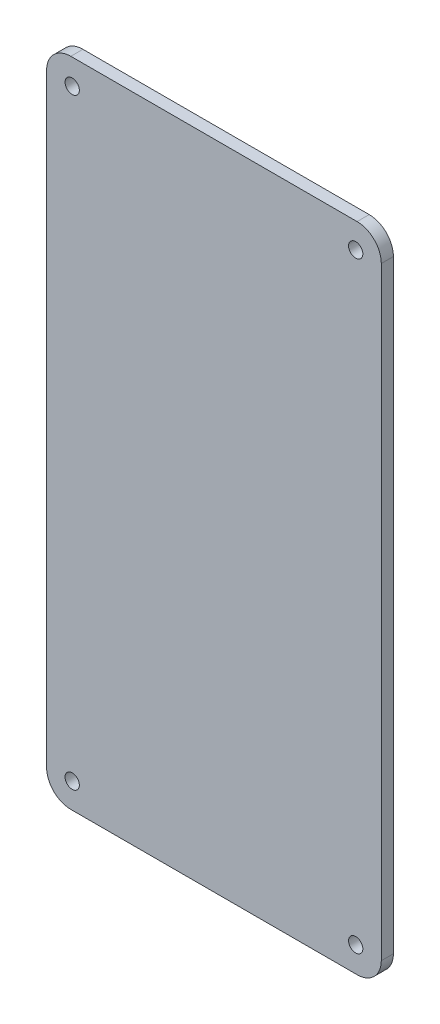
ISO-10303-21;
HEADER;
FILE_DESCRIPTION(('STEP AP214'),'2;1');
FILE_NAME('part.step','',(''),(''),'','','');
FILE_SCHEMA(('AUTOMOTIVE_DESIGN { 1 0 10303 214 1 1 1 1 }'));
ENDSEC;
DATA;
#1=APPLICATION_CONTEXT('core data for automotive mechanical design processes');
#2=APPLICATION_PROTOCOL_DEFINITION('international standard','automotive_design',2000,#1);
#3=PRODUCT_CONTEXT('',#1,'mechanical');
#4=PRODUCT('Part','Part','',(#3));
#5=PRODUCT_RELATED_PRODUCT_CATEGORY('part','',(#4));
#6=PRODUCT_DEFINITION_FORMATION('','',#4);
#7=PRODUCT_DEFINITION_CONTEXT('part definition',#1,'design');
#8=PRODUCT_DEFINITION('design','',#6,#7);
#9=PRODUCT_DEFINITION_SHAPE('','',#8);
#10=(LENGTH_UNIT() NAMED_UNIT(*) SI_UNIT(.MILLI.,.METRE.));
#11=(NAMED_UNIT(*) PLANE_ANGLE_UNIT() SI_UNIT($,.RADIAN.));
#12=(NAMED_UNIT(*) SI_UNIT($,.STERADIAN.) SOLID_ANGLE_UNIT());
#13=UNCERTAINTY_MEASURE_WITH_UNIT(LENGTH_MEASURE(1.E-05),#10,'distance_accuracy_value','');
#14=(GEOMETRIC_REPRESENTATION_CONTEXT(3) GLOBAL_UNCERTAINTY_ASSIGNED_CONTEXT((#13)) GLOBAL_UNIT_ASSIGNED_CONTEXT((#10,
#11,#12)) REPRESENTATION_CONTEXT('',''));
#15=CARTESIAN_POINT('',(0.,0.,0.));
#16=DIRECTION('',(0.,0.,1.));
#17=DIRECTION('',(1.,0.,0.));
#18=AXIS2_PLACEMENT_3D('',#15,#16,#17);
#19=CARTESIAN_POINT('',(-30.04505,-63.36755,2.54));
#20=DIRECTION('',(0.,0.,-1.));
#21=DIRECTION('',(-1.,0.,0.));
#22=AXIS2_PLACEMENT_3D('',#19,#20,#21);
#23=CYLINDRICAL_SURFACE('',#22,5.08);
#24=CARTESIAN_POINT('',(-30.04505,-63.36755,0.));
#25=DIRECTION('',(0.,0.,1.));
#26=DIRECTION('',(-1.,0.,0.));
#27=AXIS2_PLACEMENT_3D('',#24,#25,#26);
#28=CIRCLE('',#27,5.08);
#29=CARTESIAN_POINT('',(-35.12505,-63.36755,0.));
#30=VERTEX_POINT('',#29);
#31=CARTESIAN_POINT('',(-30.04505,-68.44755,0.));
#32=VERTEX_POINT('',#31);
#33=EDGE_CURVE('E146',#30,#32,#28,.T.);
#34=ORIENTED_EDGE('',*,*,#33,.T.);
#35=DIRECTION('',(0.,0.,-1.));
#36=VECTOR('',#35,1.);
#37=CARTESIAN_POINT('',(-30.04505,-68.44755,2.54));
#38=LINE('',#37,#36);
#39=CARTESIAN_POINT('',(-30.04505,-68.44755,2.54));
#40=VERTEX_POINT('',#39);
#41=EDGE_CURVE('E11',#40,#32,#38,.T.);
#42=ORIENTED_EDGE('',*,*,#41,.F.);
#43=CARTESIAN_POINT('',(-30.04505,-63.36755,2.54));
#44=DIRECTION('',(0.,0.,1.));
#45=DIRECTION('',(-1.,0.,0.));
#46=AXIS2_PLACEMENT_3D('',#43,#44,#45);
#47=CIRCLE('',#46,5.08);
#48=CARTESIAN_POINT('',(-35.12505,-63.36755,2.54));
#49=VERTEX_POINT('',#48);
#50=EDGE_CURVE('E169',#49,#40,#47,.T.);
#51=ORIENTED_EDGE('',*,*,#50,.F.);
#52=DIRECTION('',(0.,0.,-1.));
#53=VECTOR('',#52,1.);
#54=CARTESIAN_POINT('',(-35.12505,-63.36755,2.54));
#55=LINE('',#54,#53);
#56=EDGE_CURVE('E142',#49,#30,#55,.T.);
#57=ORIENTED_EDGE('',*,*,#56,.T.);
#58=EDGE_LOOP('',(#34,#42,#51,#57));
#59=FACE_BOUND('',#58,.T.);
#60=ADVANCED_FACE('F45',(#59),#23,.T.);
#61=CARTESIAN_POINT('',(-30.04505,-68.44755,2.54));
#62=DIRECTION('',(0.,1.,0.));
#63=DIRECTION('',(0.,0.,1.));
#64=AXIS2_PLACEMENT_3D('',#61,#62,#63);
#65=PLANE('',#64);
#66=DIRECTION('',(1.,0.,0.));
#67=VECTOR('',#66,1.);
#68=CARTESIAN_POINT('',(-30.04505,-68.44755,0.));
#69=LINE('',#68,#67);
#70=CARTESIAN_POINT('',(30.04505,-68.44755,0.));
#71=VERTEX_POINT('',#70);
#72=EDGE_CURVE('E150',#32,#71,#69,.T.);
#73=ORIENTED_EDGE('',*,*,#72,.T.);
#74=DIRECTION('',(0.,0.,-1.));
#75=VECTOR('',#74,1.);
#76=CARTESIAN_POINT('',(30.04505,-68.44755,2.54));
#77=LINE('',#76,#75);
#78=CARTESIAN_POINT('',(30.04505,-68.44755,2.54));
#79=VERTEX_POINT('',#78);
#80=EDGE_CURVE('E54',#79,#71,#77,.T.);
#81=ORIENTED_EDGE('',*,*,#80,.F.);
#82=DIRECTION('',(1.,0.,0.));
#83=VECTOR('',#82,1.);
#84=CARTESIAN_POINT('',(-30.04505,-68.44755,2.54));
#85=LINE('',#84,#83);
#86=EDGE_CURVE('E105',#40,#79,#85,.T.);
#87=ORIENTED_EDGE('',*,*,#86,.F.);
#88=ORIENTED_EDGE('',*,*,#41,.T.);
#89=EDGE_LOOP('',(#73,#81,#87,#88));
#90=FACE_BOUND('',#89,.T.);
#91=ADVANCED_FACE('F270',(#90),#65,.F.);
#92=CARTESIAN_POINT('',(30.04505,-63.36755,2.54));
#93=DIRECTION('',(0.,0.,-1.));
#94=DIRECTION('',(-1.,0.,0.));
#95=AXIS2_PLACEMENT_3D('',#92,#93,#94);
#96=CYLINDRICAL_SURFACE('',#95,5.08);
#97=CARTESIAN_POINT('',(30.04505,-63.36755,0.));
#98=DIRECTION('',(0.,0.,1.));
#99=DIRECTION('',(1.,0.,0.));
#100=AXIS2_PLACEMENT_3D('',#97,#98,#99);
#101=CIRCLE('',#100,5.08);
#102=CARTESIAN_POINT('',(35.12505,-63.36755,0.));
#103=VERTEX_POINT('',#102);
#104=EDGE_CURVE('E154',#71,#103,#101,.T.);
#105=ORIENTED_EDGE('',*,*,#104,.T.);
#106=DIRECTION('',(0.,0.,-1.));
#107=VECTOR('',#106,1.);
#108=CARTESIAN_POINT('',(35.12505,-63.36755,2.54));
#109=LINE('',#108,#107);
#110=CARTESIAN_POINT('',(35.12505,-63.36755,2.54));
#111=VERTEX_POINT('',#110);
#112=EDGE_CURVE('E180',#111,#103,#109,.T.);
#113=ORIENTED_EDGE('',*,*,#112,.F.);
#114=CARTESIAN_POINT('',(30.04505,-63.36755,2.54));
#115=DIRECTION('',(0.,0.,1.));
#116=DIRECTION('',(1.,0.,0.));
#117=AXIS2_PLACEMENT_3D('',#114,#115,#116);
#118=CIRCLE('',#117,5.08);
#119=EDGE_CURVE('E190',#79,#111,#118,.T.);
#120=ORIENTED_EDGE('',*,*,#119,.F.);
#121=ORIENTED_EDGE('',*,*,#80,.T.);
#122=EDGE_LOOP('',(#105,#113,#120,#121));
#123=FACE_BOUND('',#122,.T.);
#124=ADVANCED_FACE('F188',(#123),#96,.T.);
#125=CARTESIAN_POINT('',(35.12505,-63.36755,2.54));
#126=DIRECTION('',(-1.,0.,0.));
#127=DIRECTION('',(0.,0.,1.));
#128=AXIS2_PLACEMENT_3D('',#125,#126,#127);
#129=PLANE('',#128);
#130=DIRECTION('',(0.,1.,0.));
#131=VECTOR('',#130,1.);
#132=CARTESIAN_POINT('',(35.12505,-63.36755,0.));
#133=LINE('',#132,#131);
#134=CARTESIAN_POINT('',(35.12505,63.36755,0.));
#135=VERTEX_POINT('',#134);
#136=EDGE_CURVE('E157',#103,#135,#133,.T.);
#137=ORIENTED_EDGE('',*,*,#136,.T.);
#138=DIRECTION('',(0.,0.,-1.));
#139=VECTOR('',#138,1.);
#140=CARTESIAN_POINT('',(35.12505,63.36755,2.54));
#141=LINE('',#140,#139);
#142=CARTESIAN_POINT('',(35.12505,63.36755,2.54));
#143=VERTEX_POINT('',#142);
#144=EDGE_CURVE('E176',#143,#135,#141,.T.);
#145=ORIENTED_EDGE('',*,*,#144,.F.);
#146=DIRECTION('',(0.,1.,0.));
#147=VECTOR('',#146,1.);
#148=CARTESIAN_POINT('',(35.12505,-63.36755,2.54));
#149=LINE('',#148,#147);
#150=EDGE_CURVE('E203',#111,#143,#149,.T.);
#151=ORIENTED_EDGE('',*,*,#150,.F.);
#152=ORIENTED_EDGE('',*,*,#112,.T.);
#153=EDGE_LOOP('',(#137,#145,#151,#152));
#154=FACE_BOUND('',#153,.T.);
#155=ADVANCED_FACE('F198',(#154),#129,.F.);
#156=CARTESIAN_POINT('',(30.04505,63.36755,2.54));
#157=DIRECTION('',(0.,0.,-1.));
#158=DIRECTION('',(-1.,0.,0.));
#159=AXIS2_PLACEMENT_3D('',#156,#157,#158);
#160=CYLINDRICAL_SURFACE('',#159,5.08);
#161=CARTESIAN_POINT('',(30.04505,63.36755,0.));
#162=DIRECTION('',(0.,0.,1.));
#163=DIRECTION('',(-1.,0.,0.));
#164=AXIS2_PLACEMENT_3D('',#161,#162,#163);
#165=CIRCLE('',#164,5.08);
#166=CARTESIAN_POINT('',(30.04505,68.44755,0.));
#167=VERTEX_POINT('',#166);
#168=EDGE_CURVE('E160',#135,#167,#165,.T.);
#169=ORIENTED_EDGE('',*,*,#168,.T.);
#170=DIRECTION('',(0.,0.,-1.));
#171=VECTOR('',#170,1.);
#172=CARTESIAN_POINT('',(30.04505,68.44755,2.54));
#173=LINE('',#172,#171);
#174=CARTESIAN_POINT('',(30.04505,68.44755,2.54));
#175=VERTEX_POINT('',#174);
#176=EDGE_CURVE('E135',#175,#167,#173,.T.);
#177=ORIENTED_EDGE('',*,*,#176,.F.);
#178=CARTESIAN_POINT('',(30.04505,63.36755,2.54));
#179=DIRECTION('',(0.,0.,1.));
#180=DIRECTION('',(-1.,0.,0.));
#181=AXIS2_PLACEMENT_3D('',#178,#179,#180);
#182=CIRCLE('',#181,5.08);
#183=EDGE_CURVE('E124',#143,#175,#182,.T.);
#184=ORIENTED_EDGE('',*,*,#183,.F.);
#185=ORIENTED_EDGE('',*,*,#144,.T.);
#186=EDGE_LOOP('',(#169,#177,#184,#185));
#187=FACE_BOUND('',#186,.T.);
#188=ADVANCED_FACE('F201',(#187),#160,.T.);
#189=CARTESIAN_POINT('',(-30.04505,68.44755,2.54));
#190=DIRECTION('',(0.,-1.,0.));
#191=DIRECTION('',(0.,0.,-1.));
#192=AXIS2_PLACEMENT_3D('',#189,#190,#191);
#193=PLANE('',#192);
#194=DIRECTION('',(-1.,0.,0.));
#195=VECTOR('',#194,1.);
#196=CARTESIAN_POINT('',(-30.04505,68.44755,0.));
#197=LINE('',#196,#195);
#198=CARTESIAN_POINT('',(-30.04505,68.44755,0.));
#199=VERTEX_POINT('',#198);
#200=EDGE_CURVE('E133',#167,#199,#197,.T.);
#201=ORIENTED_EDGE('',*,*,#200,.T.);
#202=DIRECTION('',(0.,0.,-1.));
#203=VECTOR('',#202,1.);
#204=CARTESIAN_POINT('',(-30.04505,68.44755,2.54));
#205=LINE('',#204,#203);
#206=CARTESIAN_POINT('',(-30.04505,68.44755,2.54));
#207=VERTEX_POINT('',#206);
#208=EDGE_CURVE('E130',#207,#199,#205,.T.);
#209=ORIENTED_EDGE('',*,*,#208,.F.);
#210=DIRECTION('',(-1.,0.,0.));
#211=VECTOR('',#210,1.);
#212=CARTESIAN_POINT('',(-30.04505,68.44755,2.54));
#213=LINE('',#212,#211);
#214=EDGE_CURVE('E118',#175,#207,#213,.T.);
#215=ORIENTED_EDGE('',*,*,#214,.F.);
#216=ORIENTED_EDGE('',*,*,#176,.T.);
#217=EDGE_LOOP('',(#201,#209,#215,#216));
#218=FACE_BOUND('',#217,.T.);
#219=ADVANCED_FACE('F131',(#218),#193,.F.);
#220=CARTESIAN_POINT('',(-30.04505,63.36755,2.54));
#221=DIRECTION('',(0.,0.,-1.));
#222=DIRECTION('',(-1.,0.,0.));
#223=AXIS2_PLACEMENT_3D('',#220,#221,#222);
#224=CYLINDRICAL_SURFACE('',#223,5.08);
#225=CARTESIAN_POINT('',(-30.04505,63.36755,0.));
#226=DIRECTION('',(0.,0.,1.));
#227=DIRECTION('',(-1.,0.,0.));
#228=AXIS2_PLACEMENT_3D('',#225,#226,#227);
#229=CIRCLE('',#228,5.08);
#230=CARTESIAN_POINT('',(-35.12505,63.36755,0.));
#231=VERTEX_POINT('',#230);
#232=EDGE_CURVE('E91',#199,#231,#229,.T.);
#233=ORIENTED_EDGE('',*,*,#232,.T.);
#234=DIRECTION('',(0.,0.,-1.));
#235=VECTOR('',#234,1.);
#236=CARTESIAN_POINT('',(-35.12505,63.36755,2.54));
#237=LINE('',#236,#235);
#238=CARTESIAN_POINT('',(-35.12505,63.36755,2.54));
#239=VERTEX_POINT('',#238);
#240=EDGE_CURVE('E136',#239,#231,#237,.T.);
#241=ORIENTED_EDGE('',*,*,#240,.F.);
#242=CARTESIAN_POINT('',(-30.04505,63.36755,2.54));
#243=DIRECTION('',(0.,0.,1.));
#244=DIRECTION('',(-1.,0.,0.));
#245=AXIS2_PLACEMENT_3D('',#242,#243,#244);
#246=CIRCLE('',#245,5.08);
#247=EDGE_CURVE('E122',#207,#239,#246,.T.);
#248=ORIENTED_EDGE('',*,*,#247,.F.);
#249=ORIENTED_EDGE('',*,*,#208,.T.);
#250=EDGE_LOOP('',(#233,#241,#248,#249));
#251=FACE_BOUND('',#250,.T.);
#252=ADVANCED_FACE('F138',(#251),#224,.T.);
#253=CARTESIAN_POINT('',(-35.12505,-63.36755,2.54));
#254=DIRECTION('',(1.,0.,0.));
#255=DIRECTION('',(0.,0.,-1.));
#256=AXIS2_PLACEMENT_3D('',#253,#254,#255);
#257=PLANE('',#256);
#258=DIRECTION('',(0.,-1.,0.));
#259=VECTOR('',#258,1.);
#260=CARTESIAN_POINT('',(-35.12505,-63.36755,0.));
#261=LINE('',#260,#259);
#262=EDGE_CURVE('E97',#231,#30,#261,.T.);
#263=ORIENTED_EDGE('',*,*,#262,.T.);
#264=ORIENTED_EDGE('',*,*,#56,.F.);
#265=DIRECTION('',(0.,-1.,0.));
#266=VECTOR('',#265,1.);
#267=CARTESIAN_POINT('',(-35.12505,-63.36755,2.54));
#268=LINE('',#267,#266);
#269=EDGE_CURVE('E62',#239,#49,#268,.T.);
#270=ORIENTED_EDGE('',*,*,#269,.F.);
#271=ORIENTED_EDGE('',*,*,#240,.T.);
#272=EDGE_LOOP('',(#263,#264,#270,#271));
#273=FACE_BOUND('',#272,.T.);
#274=ADVANCED_FACE('F249',(#273),#257,.F.);
#275=CARTESIAN_POINT('',(-30.04505,-63.36755,2.54));
#276=DIRECTION('',(0.,0.,-1.));
#277=DIRECTION('',(-1.,0.,0.));
#278=AXIS2_PLACEMENT_3D('',#275,#276,#277);
#279=PLANE('',#278);
#280=CARTESIAN_POINT('',(-29.75,-63.1515,2.54));
#281=DIRECTION('',(0.,0.,1.));
#282=DIRECTION('',(1.,0.,0.));
#283=AXIS2_PLACEMENT_3D('',#280,#281,#282);
#284=CIRCLE('',#283,1.5);
#285=CARTESIAN_POINT('',(-28.25,-63.1515,2.54));
#286=VERTEX_POINT('',#285);
#287=EDGE_CURVE('E225',#286,#286,#284,.T.);
#288=ORIENTED_EDGE('',*,*,#287,.F.);
#289=EDGE_LOOP('',(#288));
#290=FACE_BOUND('',#289,.T.);
#291=CARTESIAN_POINT('',(29.75,-63.1515,2.54));
#292=DIRECTION('',(0.,0.,1.));
#293=DIRECTION('',(1.,0.,0.));
#294=AXIS2_PLACEMENT_3D('',#291,#292,#293);
#295=CIRCLE('',#294,1.5);
#296=CARTESIAN_POINT('',(31.25,-63.1515,2.54));
#297=VERTEX_POINT('',#296);
#298=EDGE_CURVE('E233',#297,#297,#295,.T.);
#299=ORIENTED_EDGE('',*,*,#298,.F.);
#300=EDGE_LOOP('',(#299));
#301=FACE_BOUND('',#300,.T.);
#302=CARTESIAN_POINT('',(29.75,63.1515,2.54));
#303=DIRECTION('',(0.,0.,1.));
#304=DIRECTION('',(1.,0.,0.));
#305=AXIS2_PLACEMENT_3D('',#302,#303,#304);
#306=CIRCLE('',#305,1.5);
#307=CARTESIAN_POINT('',(31.25,63.1515,2.54));
#308=VERTEX_POINT('',#307);
#309=EDGE_CURVE('E217',#308,#308,#306,.T.);
#310=ORIENTED_EDGE('',*,*,#309,.F.);
#311=EDGE_LOOP('',(#310));
#312=FACE_BOUND('',#311,.T.);
#313=CARTESIAN_POINT('',(-29.75,63.1515,2.54));
#314=DIRECTION('',(0.,0.,1.));
#315=DIRECTION('',(1.,0.,0.));
#316=AXIS2_PLACEMENT_3D('',#313,#314,#315);
#317=CIRCLE('',#316,1.5);
#318=CARTESIAN_POINT('',(-28.25,63.1515,2.54));
#319=VERTEX_POINT('',#318);
#320=EDGE_CURVE('E213',#319,#319,#317,.T.);
#321=ORIENTED_EDGE('',*,*,#320,.F.);
#322=EDGE_LOOP('',(#321));
#323=FACE_BOUND('',#322,.T.);
#324=ORIENTED_EDGE('',*,*,#50,.T.);
#325=ORIENTED_EDGE('',*,*,#86,.T.);
#326=ORIENTED_EDGE('',*,*,#119,.T.);
#327=ORIENTED_EDGE('',*,*,#150,.T.);
#328=ORIENTED_EDGE('',*,*,#183,.T.);
#329=ORIENTED_EDGE('',*,*,#214,.T.);
#330=ORIENTED_EDGE('',*,*,#247,.T.);
#331=ORIENTED_EDGE('',*,*,#269,.T.);
#332=EDGE_LOOP('',(#324,#325,#326,#327,#328,#329,#330,#331));
#333=FACE_BOUND('',#332,.T.);
#334=ADVANCED_FACE('F120',(#290,#301,#312,#323,#333),#279,.F.);
#335=CARTESIAN_POINT('',(-30.04505,-63.36755,0.));
#336=DIRECTION('',(0.,0.,-1.));
#337=DIRECTION('',(-1.,0.,0.));
#338=AXIS2_PLACEMENT_3D('',#335,#336,#337);
#339=PLANE('',#338);
#340=CARTESIAN_POINT('',(-29.75,-63.1515,0.));
#341=DIRECTION('',(0.,0.,1.));
#342=DIRECTION('',(1.,0.,0.));
#343=AXIS2_PLACEMENT_3D('',#340,#341,#342);
#344=CIRCLE('',#343,1.5);
#345=CARTESIAN_POINT('',(-28.25,-63.1515,0.));
#346=VERTEX_POINT('',#345);
#347=EDGE_CURVE('E221',#346,#346,#344,.T.);
#348=ORIENTED_EDGE('',*,*,#347,.T.);
#349=EDGE_LOOP('',(#348));
#350=FACE_BOUND('',#349,.T.);
#351=CARTESIAN_POINT('',(29.75,-63.1515,0.));
#352=DIRECTION('',(0.,0.,1.));
#353=DIRECTION('',(1.,0.,0.));
#354=AXIS2_PLACEMENT_3D('',#351,#352,#353);
#355=CIRCLE('',#354,1.5);
#356=CARTESIAN_POINT('',(31.25,-63.1515,0.));
#357=VERTEX_POINT('',#356);
#358=EDGE_CURVE('E229',#357,#357,#355,.T.);
#359=ORIENTED_EDGE('',*,*,#358,.T.);
#360=EDGE_LOOP('',(#359));
#361=FACE_BOUND('',#360,.T.);
#362=CARTESIAN_POINT('',(29.75,63.1515,0.));
#363=DIRECTION('',(0.,0.,1.));
#364=DIRECTION('',(1.,0.,0.));
#365=AXIS2_PLACEMENT_3D('',#362,#363,#364);
#366=CIRCLE('',#365,1.5);
#367=CARTESIAN_POINT('',(31.25,63.1515,0.));
#368=VERTEX_POINT('',#367);
#369=EDGE_CURVE('E237',#368,#368,#366,.T.);
#370=ORIENTED_EDGE('',*,*,#369,.T.);
#371=EDGE_LOOP('',(#370));
#372=FACE_BOUND('',#371,.T.);
#373=CARTESIAN_POINT('',(-29.75,63.1515,0.));
#374=DIRECTION('',(0.,0.,1.));
#375=DIRECTION('',(1.,0.,0.));
#376=AXIS2_PLACEMENT_3D('',#373,#374,#375);
#377=CIRCLE('',#376,1.5);
#378=CARTESIAN_POINT('',(-28.25,63.1515,0.));
#379=VERTEX_POINT('',#378);
#380=EDGE_CURVE('E151',#379,#379,#377,.T.);
#381=ORIENTED_EDGE('',*,*,#380,.T.);
#382=EDGE_LOOP('',(#381));
#383=FACE_BOUND('',#382,.T.);
#384=ORIENTED_EDGE('',*,*,#33,.F.);
#385=ORIENTED_EDGE('',*,*,#262,.F.);
#386=ORIENTED_EDGE('',*,*,#232,.F.);
#387=ORIENTED_EDGE('',*,*,#200,.F.);
#388=ORIENTED_EDGE('',*,*,#168,.F.);
#389=ORIENTED_EDGE('',*,*,#136,.F.);
#390=ORIENTED_EDGE('',*,*,#104,.F.);
#391=ORIENTED_EDGE('',*,*,#72,.F.);
#392=EDGE_LOOP('',(#384,#385,#386,#387,#388,#389,#390,#391));
#393=FACE_BOUND('',#392,.T.);
#394=ADVANCED_FACE('F194',(#350,#361,#372,#383,#393),#339,.T.);
#395=CARTESIAN_POINT('',(-29.75,63.1515,0.));
#396=DIRECTION('',(0.,0.,1.));
#397=DIRECTION('',(1.,0.,0.));
#398=AXIS2_PLACEMENT_3D('',#395,#396,#397);
#399=CYLINDRICAL_SURFACE('',#398,1.5);
#400=ORIENTED_EDGE('',*,*,#380,.F.);
#401=EDGE_LOOP('',(#400));
#402=FACE_BOUND('',#401,.T.);
#403=ORIENTED_EDGE('',*,*,#320,.T.);
#404=EDGE_LOOP('',(#403));
#405=FACE_BOUND('',#404,.T.);
#406=ADVANCED_FACE('F254',(#402,#405),#399,.F.);
#407=CARTESIAN_POINT('',(29.75,63.1515,0.));
#408=DIRECTION('',(0.,0.,1.));
#409=DIRECTION('',(1.,0.,0.));
#410=AXIS2_PLACEMENT_3D('',#407,#408,#409);
#411=CYLINDRICAL_SURFACE('',#410,1.5);
#412=ORIENTED_EDGE('',*,*,#369,.F.);
#413=EDGE_LOOP('',(#412));
#414=FACE_BOUND('',#413,.T.);
#415=ORIENTED_EDGE('',*,*,#309,.T.);
#416=EDGE_LOOP('',(#415));
#417=FACE_BOUND('',#416,.T.);
#418=ADVANCED_FACE('F245',(#414,#417),#411,.F.);
#419=CARTESIAN_POINT('',(29.75,-63.1515,0.));
#420=DIRECTION('',(0.,0.,1.));
#421=DIRECTION('',(1.,0.,0.));
#422=AXIS2_PLACEMENT_3D('',#419,#420,#421);
#423=CYLINDRICAL_SURFACE('',#422,1.5);
#424=ORIENTED_EDGE('',*,*,#358,.F.);
#425=EDGE_LOOP('',(#424));
#426=FACE_BOUND('',#425,.T.);
#427=ORIENTED_EDGE('',*,*,#298,.T.);
#428=EDGE_LOOP('',(#427));
#429=FACE_BOUND('',#428,.T.);
#430=ADVANCED_FACE('F262',(#426,#429),#423,.F.);
#431=CARTESIAN_POINT('',(-29.75,-63.1515,0.));
#432=DIRECTION('',(0.,0.,1.));
#433=DIRECTION('',(1.,0.,0.));
#434=AXIS2_PLACEMENT_3D('',#431,#432,#433);
#435=CYLINDRICAL_SURFACE('',#434,1.5);
#436=ORIENTED_EDGE('',*,*,#347,.F.);
#437=EDGE_LOOP('',(#436));
#438=FACE_BOUND('',#437,.T.);
#439=ORIENTED_EDGE('',*,*,#287,.T.);
#440=EDGE_LOOP('',(#439));
#441=FACE_BOUND('',#440,.T.);
#442=ADVANCED_FACE('F351',(#438,#441),#435,.F.);
#443=CLOSED_SHELL('',(#60,#91,#124,#155,#188,#219,#252,#274,#334,#394,#406,#418,#430,#442));
#444=MANIFOLD_SOLID_BREP('B2',#443);
#445=ADVANCED_BREP_SHAPE_REPRESENTATION('',(#18,#444),#14);
#446=SHAPE_DEFINITION_REPRESENTATION(#9,#445);
ENDSEC;
END-ISO-10303-21;
